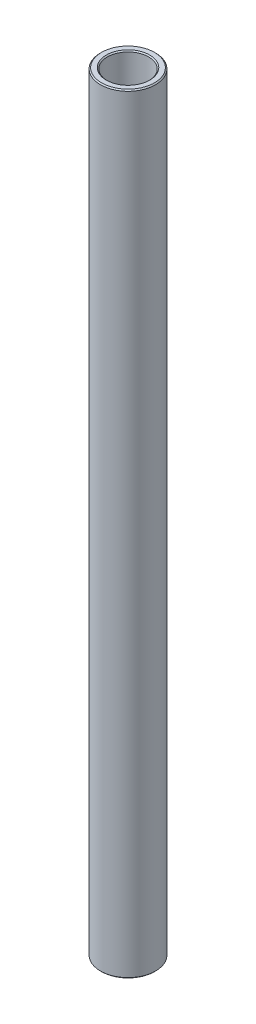
ISO-10303-21;
HEADER;
FILE_DESCRIPTION(('STEP AP214'),'2;1');
FILE_NAME('part.step','',(''),(''),'','','');
FILE_SCHEMA(('AUTOMOTIVE_DESIGN { 1 0 10303 214 1 1 1 1 }'));
ENDSEC;
DATA;
#1=APPLICATION_CONTEXT('core data for automotive mechanical design processes');
#2=APPLICATION_PROTOCOL_DEFINITION('international standard','automotive_design',2000,#1);
#3=PRODUCT_CONTEXT('',#1,'mechanical');
#4=PRODUCT('Part','Part','',(#3));
#5=PRODUCT_RELATED_PRODUCT_CATEGORY('part','',(#4));
#6=PRODUCT_DEFINITION_FORMATION('','',#4);
#7=PRODUCT_DEFINITION_CONTEXT('part definition',#1,'design');
#8=PRODUCT_DEFINITION('design','',#6,#7);
#9=PRODUCT_DEFINITION_SHAPE('','',#8);
#10=(LENGTH_UNIT() NAMED_UNIT(*) SI_UNIT(.MILLI.,.METRE.));
#11=(NAMED_UNIT(*) PLANE_ANGLE_UNIT() SI_UNIT($,.RADIAN.));
#12=(NAMED_UNIT(*) SI_UNIT($,.STERADIAN.) SOLID_ANGLE_UNIT());
#13=UNCERTAINTY_MEASURE_WITH_UNIT(LENGTH_MEASURE(1.E-05),#10,'distance_accuracy_value','');
#14=(GEOMETRIC_REPRESENTATION_CONTEXT(3) GLOBAL_UNCERTAINTY_ASSIGNED_CONTEXT((#13)) GLOBAL_UNIT_ASSIGNED_CONTEXT((#10,
#11,#12)) REPRESENTATION_CONTEXT('',''));
#15=CARTESIAN_POINT('',(0.,0.,0.));
#16=DIRECTION('',(0.,0.,1.));
#17=DIRECTION('',(1.,0.,0.));
#18=AXIS2_PLACEMENT_3D('',#15,#16,#17);
#19=CARTESIAN_POINT('',(6.35000000000029,131.762389929629,0.));
#20=DIRECTION('',(0.,-1.,0.));
#21=DIRECTION('',(1.,0.,0.));
#22=AXIS2_PLACEMENT_3D('',#19,#20,#21);
#23=PLANE('',#22);
#24=CARTESIAN_POINT('',(0.,131.762389929629,0.));
#25=DIRECTION('',(0.,-1.,0.));
#26=DIRECTION('',(1.,0.,0.));
#27=AXIS2_PLACEMENT_3D('',#24,#25,#26);
#28=CIRCLE('',#27,5.01650000000017);
#29=CARTESIAN_POINT('',(5.01650000000008,131.762389929629,0.));
#30=VERTEX_POINT('',#29);
#31=EDGE_CURVE('E10',#30,#30,#28,.F.);
#32=ORIENTED_EDGE('',*,*,#31,.T.);
#33=EDGE_LOOP('',(#32));
#34=FACE_BOUND('',#33,.T.);
#35=CARTESIAN_POINT('',(0.,131.762389929629,0.));
#36=DIRECTION('',(0.,-1.,0.));
#37=DIRECTION('',(1.,0.,0.));
#38=AXIS2_PLACEMENT_3D('',#35,#36,#37);
#39=CIRCLE('',#38,6.09600000000038);
#40=CARTESIAN_POINT('',(6.09600000000029,131.762389929629,0.));
#41=VERTEX_POINT('',#40);
#42=EDGE_CURVE('E38',#41,#41,#39,.T.);
#43=ORIENTED_EDGE('',*,*,#42,.T.);
#44=EDGE_LOOP('',(#43));
#45=FACE_BOUND('',#44,.T.);
#46=ADVANCED_FACE('F31',(#34,#45),#23,.T.);
#47=CARTESIAN_POINT('',(0.,122.237389929629,0.));
#48=DIRECTION('',(0.,-1.,0.));
#49=DIRECTION('',(1.,0.,0.));
#50=AXIS2_PLACEMENT_3D('',#47,#48,#49);
#51=CYLINDRICAL_SURFACE('',#50,4.76250000000093);
#52=CARTESIAN_POINT('',(-1.74070817211398E-12,308.968621868517,0.));
#53=DIRECTION('',(0.,1.,0.));
#54=DIRECTION('',(-1.,0.,0.));
#55=AXIS2_PLACEMENT_3D('',#52,#53,#54);
#56=CIRCLE('',#55,4.76250000000093);
#57=CARTESIAN_POINT('',(-4.76250000000267,308.968621868517,0.));
#58=VERTEX_POINT('',#57);
#59=EDGE_CURVE('E42',#58,#58,#56,.T.);
#60=ORIENTED_EDGE('',*,*,#59,.T.);
#61=EDGE_LOOP('',(#60));
#62=FACE_BOUND('',#61,.T.);
#63=CARTESIAN_POINT('',(0.,132.016389929628,0.));
#64=DIRECTION('',(0.,-1.,0.));
#65=DIRECTION('',(1.,0.,0.));
#66=AXIS2_PLACEMENT_3D('',#63,#64,#65);
#67=CIRCLE('',#66,4.76250000000093);
#68=CARTESIAN_POINT('',(4.76250000000084,132.016389929628,0.));
#69=VERTEX_POINT('',#68);
#70=EDGE_CURVE('E46',#69,#69,#67,.T.);
#71=ORIENTED_EDGE('',*,*,#70,.T.);
#72=EDGE_LOOP('',(#71));
#73=FACE_BOUND('',#72,.T.);
#74=ADVANCED_FACE('F75',(#62,#73),#51,.F.);
#75=CARTESIAN_POINT('',(4.76250000000001,309.222621868518,0.));
#76=DIRECTION('',(0.,1.,0.));
#77=DIRECTION('',(-1.,0.,0.));
#78=AXIS2_PLACEMENT_3D('',#75,#76,#77);
#79=PLANE('',#78);
#80=CARTESIAN_POINT('',(-1.74307595960795E-12,309.222621868518,0.));
#81=DIRECTION('',(0.,1.,0.));
#82=DIRECTION('',(-1.,0.,0.));
#83=AXIS2_PLACEMENT_3D('',#80,#81,#82);
#84=CIRCLE('',#83,6.09600000000198);
#85=CARTESIAN_POINT('',(-6.09600000000373,309.222621868518,0.));
#86=VERTEX_POINT('',#85);
#87=EDGE_CURVE('E51',#86,#86,#84,.T.);
#88=ORIENTED_EDGE('',*,*,#87,.T.);
#89=EDGE_LOOP('',(#88));
#90=FACE_BOUND('',#89,.T.);
#91=CARTESIAN_POINT('',(-1.74307595960795E-12,309.222621868518,0.));
#92=DIRECTION('',(0.,1.,0.));
#93=DIRECTION('',(-1.,0.,0.));
#94=AXIS2_PLACEMENT_3D('',#91,#92,#93);
#95=CIRCLE('',#94,5.01650000000173);
#96=CARTESIAN_POINT('',(-5.01650000000347,309.222621868518,0.));
#97=VERTEX_POINT('',#96);
#98=EDGE_CURVE('E54',#97,#97,#95,.F.);
#99=ORIENTED_EDGE('',*,*,#98,.T.);
#100=EDGE_LOOP('',(#99));
#101=FACE_BOUND('',#100,.T.);
#102=ADVANCED_FACE('F80',(#90,#101),#79,.T.);
#103=CARTESIAN_POINT('',(0.,122.237389929629,0.));
#104=DIRECTION('',(0.,-1.,0.));
#105=DIRECTION('',(1.,0.,0.));
#106=AXIS2_PLACEMENT_3D('',#103,#104,#105);
#107=CYLINDRICAL_SURFACE('',#106,6.3500000000012);
#108=CARTESIAN_POINT('',(-1.74070817211399E-12,308.968621868519,0.));
#109=DIRECTION('',(0.,1.,0.));
#110=DIRECTION('',(-1.,0.,0.));
#111=AXIS2_PLACEMENT_3D('',#108,#109,#110);
#112=CIRCLE('',#111,6.3500000000012);
#113=CARTESIAN_POINT('',(-6.35000000000294,308.968621868519,0.));
#114=VERTEX_POINT('',#113);
#115=EDGE_CURVE('E57',#114,#114,#112,.F.);
#116=ORIENTED_EDGE('',*,*,#115,.T.);
#117=EDGE_LOOP('',(#116));
#118=FACE_BOUND('',#117,.T.);
#119=CARTESIAN_POINT('',(0.,132.01638992963,0.));
#120=DIRECTION('',(0.,-1.,0.));
#121=DIRECTION('',(1.,0.,0.));
#122=AXIS2_PLACEMENT_3D('',#119,#120,#121);
#123=CIRCLE('',#122,6.3500000000012);
#124=CARTESIAN_POINT('',(6.35000000000111,132.01638992963,0.));
#125=VERTEX_POINT('',#124);
#126=EDGE_CURVE('E60',#125,#125,#123,.F.);
#127=ORIENTED_EDGE('',*,*,#126,.T.);
#128=EDGE_LOOP('',(#127));
#129=FACE_BOUND('',#128,.T.);
#130=ADVANCED_FACE('F64',(#118,#129),#107,.T.);
#131=CARTESIAN_POINT('',(-1.74070817211399E-12,308.968621868519,0.));
#132=DIRECTION('',(0.,-1.,0.));
#133=DIRECTION('',(1.,0.,0.));
#134=AXIS2_PLACEMENT_3D('',#131,#132,#133);
#135=CONICAL_SURFACE('',#134,6.3500000000012,0.785398163397464);
#136=ORIENTED_EDGE('',*,*,#87,.F.);
#137=EDGE_LOOP('',(#136));
#138=FACE_BOUND('',#137,.T.);
#139=ORIENTED_EDGE('',*,*,#115,.F.);
#140=EDGE_LOOP('',(#139));
#141=FACE_BOUND('',#140,.T.);
#142=ADVANCED_FACE('F85',(#138,#141),#135,.T.);
#143=CARTESIAN_POINT('',(-1.74307595960795E-12,309.222621868518,0.));
#144=DIRECTION('',(0.,1.,0.));
#145=DIRECTION('',(-1.,0.,0.));
#146=AXIS2_PLACEMENT_3D('',#143,#144,#145);
#147=CONICAL_SURFACE('',#146,5.01650000000172,0.78539816339752);
#148=ORIENTED_EDGE('',*,*,#59,.F.);
#149=EDGE_LOOP('',(#148));
#150=FACE_BOUND('',#149,.T.);
#151=ORIENTED_EDGE('',*,*,#98,.F.);
#152=EDGE_LOOP('',(#151));
#153=FACE_BOUND('',#152,.T.);
#154=ADVANCED_FACE('F72',(#150,#153),#147,.F.);
#155=CARTESIAN_POINT('',(0.,132.016389929628,0.));
#156=DIRECTION('',(0.,-1.,0.));
#157=DIRECTION('',(1.,0.,0.));
#158=AXIS2_PLACEMENT_3D('',#155,#156,#157);
#159=CONICAL_SURFACE('',#158,4.76250000000093,0.785398163397465);
#160=ORIENTED_EDGE('',*,*,#31,.F.);
#161=EDGE_LOOP('',(#160));
#162=FACE_BOUND('',#161,.T.);
#163=ORIENTED_EDGE('',*,*,#70,.F.);
#164=EDGE_LOOP('',(#163));
#165=FACE_BOUND('',#164,.T.);
#166=ADVANCED_FACE('F68',(#162,#165),#159,.F.);
#167=CARTESIAN_POINT('',(0.,131.762389929629,0.));
#168=DIRECTION('',(0.,1.,0.));
#169=DIRECTION('',(-1.,0.,0.));
#170=AXIS2_PLACEMENT_3D('',#167,#168,#169);
#171=CONICAL_SURFACE('',#170,6.09600000000038,0.785398163397421);
#172=ORIENTED_EDGE('',*,*,#126,.F.);
#173=EDGE_LOOP('',(#172));
#174=FACE_BOUND('',#173,.T.);
#175=ORIENTED_EDGE('',*,*,#42,.F.);
#176=EDGE_LOOP('',(#175));
#177=FACE_BOUND('',#176,.T.);
#178=ADVANCED_FACE('F33',(#174,#177),#171,.T.);
#179=CLOSED_SHELL('',(#46,#74,#102,#130,#142,#154,#166,#178));
#180=MANIFOLD_SOLID_BREP('B2',#179);
#181=ADVANCED_BREP_SHAPE_REPRESENTATION('',(#18,#180),#14);
#182=SHAPE_DEFINITION_REPRESENTATION(#9,#181);
ENDSEC;
END-ISO-10303-21;
